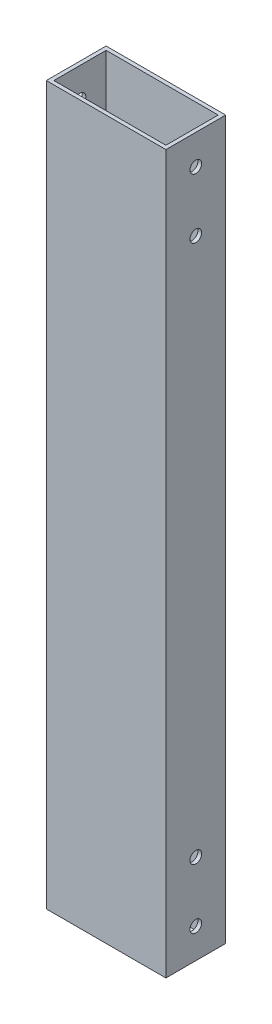
ISO-10303-21;
HEADER;
FILE_DESCRIPTION(('STEP AP214'),'2;1');
FILE_NAME('part.step','',(''),(''),'','','');
FILE_SCHEMA(('AUTOMOTIVE_DESIGN { 1 0 10303 214 1 1 1 1 }'));
ENDSEC;
DATA;
#1=APPLICATION_CONTEXT('core data for automotive mechanical design processes');
#2=APPLICATION_PROTOCOL_DEFINITION('international standard','automotive_design',2000,#1);
#3=PRODUCT_CONTEXT('',#1,'mechanical');
#4=PRODUCT('Part','Part','',(#3));
#5=PRODUCT_RELATED_PRODUCT_CATEGORY('part','',(#4));
#6=PRODUCT_DEFINITION_FORMATION('','',#4);
#7=PRODUCT_DEFINITION_CONTEXT('part definition',#1,'design');
#8=PRODUCT_DEFINITION('design','',#6,#7);
#9=PRODUCT_DEFINITION_SHAPE('','',#8);
#10=(LENGTH_UNIT() NAMED_UNIT(*) SI_UNIT(.MILLI.,.METRE.));
#11=(NAMED_UNIT(*) PLANE_ANGLE_UNIT() SI_UNIT($,.RADIAN.));
#12=(NAMED_UNIT(*) SI_UNIT($,.STERADIAN.) SOLID_ANGLE_UNIT());
#13=UNCERTAINTY_MEASURE_WITH_UNIT(LENGTH_MEASURE(1.E-05),#10,'distance_accuracy_value','');
#14=(GEOMETRIC_REPRESENTATION_CONTEXT(3) GLOBAL_UNCERTAINTY_ASSIGNED_CONTEXT((#13)) GLOBAL_UNIT_ASSIGNED_CONTEXT((#10,
#11,#12)) REPRESENTATION_CONTEXT('',''));
#15=CARTESIAN_POINT('',(0.,0.,0.));
#16=DIRECTION('',(0.,0.,1.));
#17=DIRECTION('',(1.,0.,0.));
#18=AXIS2_PLACEMENT_3D('',#15,#16,#17);
#19=CARTESIAN_POINT('',(0.,12.7,-12.7));
#20=DIRECTION('',(1.,0.,0.));
#21=DIRECTION('',(0.,0.,-1.));
#22=AXIS2_PLACEMENT_3D('',#19,#20,#21);
#23=CYLINDRICAL_SURFACE('',#22,2.4892);
#24=CARTESIAN_POINT('',(1.5875,12.7,-12.7));
#25=DIRECTION('',(-1.,0.,0.));
#26=DIRECTION('',(0.,0.,-1.));
#27=AXIS2_PLACEMENT_3D('',#24,#25,#26);
#28=CIRCLE('',#27,2.4892);
#29=CARTESIAN_POINT('',(1.5875,12.7,-15.1892));
#30=VERTEX_POINT('',#29);
#31=EDGE_CURVE('E165',#30,#30,#28,.T.);
#32=ORIENTED_EDGE('',*,*,#31,.F.);
#33=EDGE_LOOP('',(#32));
#34=FACE_BOUND('',#33,.T.);
#35=CARTESIAN_POINT('',(0.,12.7,-12.7));
#36=DIRECTION('',(-1.,0.,0.));
#37=DIRECTION('',(0.,0.,-1.));
#38=AXIS2_PLACEMENT_3D('',#35,#36,#37);
#39=CIRCLE('',#38,2.4892);
#40=CARTESIAN_POINT('',(0.,12.7,-15.1892));
#41=VERTEX_POINT('',#40);
#42=EDGE_CURVE('E190',#41,#41,#39,.T.);
#43=ORIENTED_EDGE('',*,*,#42,.T.);
#44=EDGE_LOOP('',(#43));
#45=FACE_BOUND('',#44,.T.);
#46=ADVANCED_FACE('F15',(#34,#45),#23,.F.);
#47=CARTESIAN_POINT('',(0.,38.1,-12.7));
#48=DIRECTION('',(1.,0.,0.));
#49=DIRECTION('',(0.,0.,-1.));
#50=AXIS2_PLACEMENT_3D('',#47,#48,#49);
#51=CYLINDRICAL_SURFACE('',#50,2.4892);
#52=CARTESIAN_POINT('',(1.5875,38.1,-12.7));
#53=DIRECTION('',(-1.,0.,0.));
#54=DIRECTION('',(0.,0.,-1.));
#55=AXIS2_PLACEMENT_3D('',#52,#53,#54);
#56=CIRCLE('',#55,2.4892);
#57=CARTESIAN_POINT('',(1.5875,38.1,-15.1892));
#58=VERTEX_POINT('',#57);
#59=EDGE_CURVE('E156',#58,#58,#56,.T.);
#60=ORIENTED_EDGE('',*,*,#59,.F.);
#61=EDGE_LOOP('',(#60));
#62=FACE_BOUND('',#61,.T.);
#63=CARTESIAN_POINT('',(0.,38.1,-12.7));
#64=DIRECTION('',(-1.,0.,0.));
#65=DIRECTION('',(0.,0.,-1.));
#66=AXIS2_PLACEMENT_3D('',#63,#64,#65);
#67=CIRCLE('',#66,2.4892);
#68=CARTESIAN_POINT('',(0.,38.1,-15.1892));
#69=VERTEX_POINT('',#68);
#70=EDGE_CURVE('E186',#69,#69,#67,.T.);
#71=ORIENTED_EDGE('',*,*,#70,.T.);
#72=EDGE_LOOP('',(#71));
#73=FACE_BOUND('',#72,.T.);
#74=ADVANCED_FACE('F281',(#62,#73),#51,.F.);
#75=CARTESIAN_POINT('',(0.,12.7,-12.7));
#76=DIRECTION('',(1.,0.,0.));
#77=DIRECTION('',(0.,0.,-1.));
#78=AXIS2_PLACEMENT_3D('',#75,#76,#77);
#79=CYLINDRICAL_SURFACE('',#78,2.4892);
#80=CARTESIAN_POINT('',(49.2125,12.7,-12.7));
#81=DIRECTION('',(1.,0.,0.));
#82=DIRECTION('',(0.,0.,1.));
#83=AXIS2_PLACEMENT_3D('',#80,#81,#82);
#84=CIRCLE('',#83,2.4892);
#85=CARTESIAN_POINT('',(49.2125,12.7,-10.2108));
#86=VERTEX_POINT('',#85);
#87=EDGE_CURVE('E264',#86,#86,#84,.T.);
#88=ORIENTED_EDGE('',*,*,#87,.F.);
#89=EDGE_LOOP('',(#88));
#90=FACE_BOUND('',#89,.T.);
#91=CARTESIAN_POINT('',(50.8,12.7,-12.7));
#92=DIRECTION('',(-1.,0.,0.));
#93=DIRECTION('',(0.,0.,-1.));
#94=AXIS2_PLACEMENT_3D('',#91,#92,#93);
#95=CIRCLE('',#94,2.4892);
#96=CARTESIAN_POINT('',(50.8,12.7,-15.1892));
#97=VERTEX_POINT('',#96);
#98=EDGE_CURVE('E207',#97,#97,#95,.T.);
#99=ORIENTED_EDGE('',*,*,#98,.F.);
#100=EDGE_LOOP('',(#99));
#101=FACE_BOUND('',#100,.T.);
#102=ADVANCED_FACE('F277',(#90,#101),#79,.F.);
#103=CARTESIAN_POINT('',(0.,38.1,-12.7));
#104=DIRECTION('',(1.,0.,0.));
#105=DIRECTION('',(0.,0.,-1.));
#106=AXIS2_PLACEMENT_3D('',#103,#104,#105);
#107=CYLINDRICAL_SURFACE('',#106,2.4892);
#108=CARTESIAN_POINT('',(49.2125,38.1,-12.7));
#109=DIRECTION('',(1.,0.,0.));
#110=DIRECTION('',(0.,0.,1.));
#111=AXIS2_PLACEMENT_3D('',#108,#109,#110);
#112=CIRCLE('',#111,2.4892);
#113=CARTESIAN_POINT('',(49.2125,38.1,-10.2108));
#114=VERTEX_POINT('',#113);
#115=EDGE_CURVE('E267',#114,#114,#112,.T.);
#116=ORIENTED_EDGE('',*,*,#115,.F.);
#117=EDGE_LOOP('',(#116));
#118=FACE_BOUND('',#117,.T.);
#119=CARTESIAN_POINT('',(50.8,38.1,-12.7));
#120=DIRECTION('',(-1.,0.,0.));
#121=DIRECTION('',(0.,0.,-1.));
#122=AXIS2_PLACEMENT_3D('',#119,#120,#121);
#123=CIRCLE('',#122,2.4892);
#124=CARTESIAN_POINT('',(50.8,38.1,-15.1892));
#125=VERTEX_POINT('',#124);
#126=EDGE_CURVE('E203',#125,#125,#123,.T.);
#127=ORIENTED_EDGE('',*,*,#126,.F.);
#128=EDGE_LOOP('',(#127));
#129=FACE_BOUND('',#128,.T.);
#130=ADVANCED_FACE('F280',(#118,#129),#107,.F.);
#131=CARTESIAN_POINT('',(0.,292.1,-12.7));
#132=DIRECTION('',(1.,0.,0.));
#133=DIRECTION('',(0.,0.,-1.));
#134=AXIS2_PLACEMENT_3D('',#131,#132,#133);
#135=CYLINDRICAL_SURFACE('',#134,2.4892);
#136=CARTESIAN_POINT('',(1.5875,292.1,-12.7));
#137=DIRECTION('',(1.,0.,0.));
#138=DIRECTION('',(0.,0.,-1.));
#139=AXIS2_PLACEMENT_3D('',#136,#137,#138);
#140=CIRCLE('',#139,2.4892);
#141=CARTESIAN_POINT('',(1.5875,292.1,-15.1892));
#142=VERTEX_POINT('',#141);
#143=EDGE_CURVE('E150',#142,#142,#140,.T.);
#144=ORIENTED_EDGE('',*,*,#143,.T.);
#145=EDGE_LOOP('',(#144));
#146=FACE_BOUND('',#145,.T.);
#147=CARTESIAN_POINT('',(0.,292.1,-12.7));
#148=DIRECTION('',(1.,0.,0.));
#149=DIRECTION('',(0.,0.,-1.));
#150=AXIS2_PLACEMENT_3D('',#147,#148,#149);
#151=CIRCLE('',#150,2.4892);
#152=CARTESIAN_POINT('',(0.,292.1,-15.1892));
#153=VERTEX_POINT('',#152);
#154=EDGE_CURVE('E189',#153,#153,#151,.T.);
#155=ORIENTED_EDGE('',*,*,#154,.F.);
#156=EDGE_LOOP('',(#155));
#157=FACE_BOUND('',#156,.T.);
#158=ADVANCED_FACE('F151',(#146,#157),#135,.F.);
#159=CARTESIAN_POINT('',(0.,266.7,-12.7));
#160=DIRECTION('',(1.,0.,0.));
#161=DIRECTION('',(0.,0.,-1.));
#162=AXIS2_PLACEMENT_3D('',#159,#160,#161);
#163=CYLINDRICAL_SURFACE('',#162,2.4892);
#164=CARTESIAN_POINT('',(1.5875,266.7,-12.7));
#165=DIRECTION('',(1.,0.,0.));
#166=DIRECTION('',(0.,0.,-1.));
#167=AXIS2_PLACEMENT_3D('',#164,#165,#166);
#168=CIRCLE('',#167,2.4892);
#169=CARTESIAN_POINT('',(1.5875,266.7,-15.1892));
#170=VERTEX_POINT('',#169);
#171=EDGE_CURVE('E155',#170,#170,#168,.T.);
#172=ORIENTED_EDGE('',*,*,#171,.T.);
#173=EDGE_LOOP('',(#172));
#174=FACE_BOUND('',#173,.T.);
#175=CARTESIAN_POINT('',(0.,266.7,-12.7));
#176=DIRECTION('',(1.,0.,0.));
#177=DIRECTION('',(0.,0.,-1.));
#178=AXIS2_PLACEMENT_3D('',#175,#176,#177);
#179=CIRCLE('',#178,2.4892);
#180=CARTESIAN_POINT('',(0.,266.7,-15.1892));
#181=VERTEX_POINT('',#180);
#182=EDGE_CURVE('E19',#181,#181,#179,.T.);
#183=ORIENTED_EDGE('',*,*,#182,.F.);
#184=EDGE_LOOP('',(#183));
#185=FACE_BOUND('',#184,.T.);
#186=ADVANCED_FACE('F378',(#174,#185),#163,.F.);
#187=CARTESIAN_POINT('',(0.,292.1,-12.7));
#188=DIRECTION('',(1.,0.,0.));
#189=DIRECTION('',(0.,0.,-1.));
#190=AXIS2_PLACEMENT_3D('',#187,#188,#189);
#191=CYLINDRICAL_SURFACE('',#190,2.4892);
#192=CARTESIAN_POINT('',(49.2125,292.1,-12.7));
#193=DIRECTION('',(-1.,0.,0.));
#194=DIRECTION('',(0.,0.,1.));
#195=AXIS2_PLACEMENT_3D('',#192,#193,#194);
#196=CIRCLE('',#195,2.4892);
#197=CARTESIAN_POINT('',(49.2125,292.1,-10.2108));
#198=VERTEX_POINT('',#197);
#199=EDGE_CURVE('E26',#198,#198,#196,.T.);
#200=ORIENTED_EDGE('',*,*,#199,.T.);
#201=EDGE_LOOP('',(#200));
#202=FACE_BOUND('',#201,.T.);
#203=CARTESIAN_POINT('',(50.8,292.1,-12.7));
#204=DIRECTION('',(1.,0.,0.));
#205=DIRECTION('',(0.,0.,-1.));
#206=AXIS2_PLACEMENT_3D('',#203,#204,#205);
#207=CIRCLE('',#206,2.4892);
#208=CARTESIAN_POINT('',(50.8,292.1,-15.1892));
#209=VERTEX_POINT('',#208);
#210=EDGE_CURVE('E206',#209,#209,#207,.T.);
#211=ORIENTED_EDGE('',*,*,#210,.T.);
#212=EDGE_LOOP('',(#211));
#213=FACE_BOUND('',#212,.T.);
#214=ADVANCED_FACE('F380',(#202,#213),#191,.F.);
#215=CARTESIAN_POINT('',(0.,266.7,-12.7));
#216=DIRECTION('',(1.,0.,0.));
#217=DIRECTION('',(0.,0.,-1.));
#218=AXIS2_PLACEMENT_3D('',#215,#216,#217);
#219=CYLINDRICAL_SURFACE('',#218,2.4892);
#220=CARTESIAN_POINT('',(49.2125,266.7,-12.7));
#221=DIRECTION('',(-1.,0.,0.));
#222=DIRECTION('',(0.,0.,1.));
#223=AXIS2_PLACEMENT_3D('',#220,#221,#222);
#224=CIRCLE('',#223,2.4892);
#225=CARTESIAN_POINT('',(49.2125,266.7,-10.2108));
#226=VERTEX_POINT('',#225);
#227=EDGE_CURVE('E10',#226,#226,#224,.T.);
#228=ORIENTED_EDGE('',*,*,#227,.T.);
#229=EDGE_LOOP('',(#228));
#230=FACE_BOUND('',#229,.T.);
#231=CARTESIAN_POINT('',(50.8,266.7,-12.7));
#232=DIRECTION('',(1.,0.,0.));
#233=DIRECTION('',(0.,0.,-1.));
#234=AXIS2_PLACEMENT_3D('',#231,#232,#233);
#235=CIRCLE('',#234,2.4892);
#236=CARTESIAN_POINT('',(50.8,266.7,-15.1892));
#237=VERTEX_POINT('',#236);
#238=EDGE_CURVE('E232',#237,#237,#235,.T.);
#239=ORIENTED_EDGE('',*,*,#238,.T.);
#240=EDGE_LOOP('',(#239));
#241=FACE_BOUND('',#240,.T.);
#242=ADVANCED_FACE('F386',(#230,#241),#219,.F.);
#243=CARTESIAN_POINT('',(1.5875,304.8,-23.8125));
#244=DIRECTION('',(0.,0.,1.));
#245=DIRECTION('',(1.,0.,0.));
#246=AXIS2_PLACEMENT_3D('',#243,#244,#245);
#247=PLANE('',#246);
#248=DIRECTION('',(-1.,0.,0.));
#249=VECTOR('',#248,1.);
#250=CARTESIAN_POINT('',(1.5875,0.,-23.8125));
#251=LINE('',#250,#249);
#252=CARTESIAN_POINT('',(49.2125,0.,-23.8125));
#253=VERTEX_POINT('',#252);
#254=CARTESIAN_POINT('',(1.5875,0.,-23.8125));
#255=VERTEX_POINT('',#254);
#256=EDGE_CURVE('E185',#253,#255,#251,.T.);
#257=ORIENTED_EDGE('',*,*,#256,.F.);
#258=DIRECTION('',(0.,-1.,0.));
#259=VECTOR('',#258,1.);
#260=CARTESIAN_POINT('',(49.2125,304.8,-23.8125));
#261=LINE('',#260,#259);
#262=CARTESIAN_POINT('',(49.2125,304.8,-23.8125));
#263=VERTEX_POINT('',#262);
#264=EDGE_CURVE('E260',#263,#253,#261,.T.);
#265=ORIENTED_EDGE('',*,*,#264,.F.);
#266=DIRECTION('',(-1.,0.,0.));
#267=VECTOR('',#266,1.);
#268=CARTESIAN_POINT('',(1.5875,304.8,-23.8125));
#269=LINE('',#268,#267);
#270=CARTESIAN_POINT('',(1.5875,304.8,-23.8125));
#271=VERTEX_POINT('',#270);
#272=EDGE_CURVE('E227',#263,#271,#269,.T.);
#273=ORIENTED_EDGE('',*,*,#272,.T.);
#274=DIRECTION('',(0.,-1.,0.));
#275=VECTOR('',#274,1.);
#276=CARTESIAN_POINT('',(1.5875,304.8,-23.8125));
#277=LINE('',#276,#275);
#278=EDGE_CURVE('E235',#271,#255,#277,.T.);
#279=ORIENTED_EDGE('',*,*,#278,.T.);
#280=EDGE_LOOP('',(#257,#265,#273,#279));
#281=FACE_BOUND('',#280,.T.);
#282=ADVANCED_FACE('F326',(#281),#247,.T.);
#283=CARTESIAN_POINT('',(49.2125,304.8,-1.5875));
#284=DIRECTION('',(-1.,0.,0.));
#285=DIRECTION('',(0.,0.,1.));
#286=AXIS2_PLACEMENT_3D('',#283,#284,#285);
#287=PLANE('',#286);
#288=ORIENTED_EDGE('',*,*,#227,.F.);
#289=EDGE_LOOP('',(#288));
#290=FACE_BOUND('',#289,.T.);
#291=ORIENTED_EDGE('',*,*,#199,.F.);
#292=EDGE_LOOP('',(#291));
#293=FACE_BOUND('',#292,.T.);
#294=ORIENTED_EDGE('',*,*,#115,.T.);
#295=EDGE_LOOP('',(#294));
#296=FACE_BOUND('',#295,.T.);
#297=ORIENTED_EDGE('',*,*,#87,.T.);
#298=EDGE_LOOP('',(#297));
#299=FACE_BOUND('',#298,.T.);
#300=DIRECTION('',(0.,0.,-1.));
#301=VECTOR('',#300,1.);
#302=CARTESIAN_POINT('',(49.2125,0.,-1.5875));
#303=LINE('',#302,#301);
#304=CARTESIAN_POINT('',(49.2125,0.,-1.5875));
#305=VERTEX_POINT('',#304);
#306=EDGE_CURVE('E196',#305,#253,#303,.T.);
#307=ORIENTED_EDGE('',*,*,#306,.F.);
#308=DIRECTION('',(0.,-1.,0.));
#309=VECTOR('',#308,1.);
#310=CARTESIAN_POINT('',(49.2125,304.8,-1.5875));
#311=LINE('',#310,#309);
#312=CARTESIAN_POINT('',(49.2125,304.8,-1.5875));
#313=VERTEX_POINT('',#312);
#314=EDGE_CURVE('E163',#313,#305,#311,.T.);
#315=ORIENTED_EDGE('',*,*,#314,.F.);
#316=DIRECTION('',(0.,0.,-1.));
#317=VECTOR('',#316,1.);
#318=CARTESIAN_POINT('',(49.2125,304.8,-1.5875));
#319=LINE('',#318,#317);
#320=EDGE_CURVE('E179',#313,#263,#319,.T.);
#321=ORIENTED_EDGE('',*,*,#320,.T.);
#322=ORIENTED_EDGE('',*,*,#264,.T.);
#323=EDGE_LOOP('',(#307,#315,#321,#322));
#324=FACE_BOUND('',#323,.T.);
#325=ADVANCED_FACE('F274',(#290,#293,#296,#299,#324),#287,.T.);
#326=CARTESIAN_POINT('',(1.5875,304.8,-1.5875));
#327=DIRECTION('',(0.,0.,-1.));
#328=DIRECTION('',(0.,-1.,0.));
#329=AXIS2_PLACEMENT_3D('',#326,#327,#328);
#330=PLANE('',#329);
#331=DIRECTION('',(1.,0.,0.));
#332=VECTOR('',#331,1.);
#333=CARTESIAN_POINT('',(1.5875,0.,-1.5875));
#334=LINE('',#333,#332);
#335=CARTESIAN_POINT('',(1.5875,0.,-1.5875));
#336=VERTEX_POINT('',#335);
#337=EDGE_CURVE('E184',#336,#305,#334,.T.);
#338=ORIENTED_EDGE('',*,*,#337,.F.);
#339=DIRECTION('',(0.,-1.,0.));
#340=VECTOR('',#339,1.);
#341=CARTESIAN_POINT('',(1.5875,304.8,-1.5875));
#342=LINE('',#341,#340);
#343=CARTESIAN_POINT('',(1.5875,304.8,-1.5875));
#344=VERTEX_POINT('',#343);
#345=EDGE_CURVE('E173',#344,#336,#342,.T.);
#346=ORIENTED_EDGE('',*,*,#345,.F.);
#347=DIRECTION('',(1.,0.,0.));
#348=VECTOR('',#347,1.);
#349=CARTESIAN_POINT('',(1.5875,304.8,-1.5875));
#350=LINE('',#349,#348);
#351=EDGE_CURVE('E174',#344,#313,#350,.T.);
#352=ORIENTED_EDGE('',*,*,#351,.T.);
#353=ORIENTED_EDGE('',*,*,#314,.T.);
#354=EDGE_LOOP('',(#338,#346,#352,#353));
#355=FACE_BOUND('',#354,.T.);
#356=ADVANCED_FACE('F317',(#355),#330,.T.);
#357=CARTESIAN_POINT('',(1.5875,304.8,-1.5875));
#358=DIRECTION('',(1.,0.,0.));
#359=DIRECTION('',(0.,1.,0.));
#360=AXIS2_PLACEMENT_3D('',#357,#358,#359);
#361=PLANE('',#360);
#362=ORIENTED_EDGE('',*,*,#171,.F.);
#363=EDGE_LOOP('',(#362));
#364=FACE_BOUND('',#363,.T.);
#365=ORIENTED_EDGE('',*,*,#143,.F.);
#366=EDGE_LOOP('',(#365));
#367=FACE_BOUND('',#366,.T.);
#368=ORIENTED_EDGE('',*,*,#59,.T.);
#369=EDGE_LOOP('',(#368));
#370=FACE_BOUND('',#369,.T.);
#371=ORIENTED_EDGE('',*,*,#31,.T.);
#372=EDGE_LOOP('',(#371));
#373=FACE_BOUND('',#372,.T.);
#374=DIRECTION('',(0.,0.,1.));
#375=VECTOR('',#374,1.);
#376=CARTESIAN_POINT('',(1.5875,0.,-1.5875));
#377=LINE('',#376,#375);
#378=EDGE_CURVE('E180',#255,#336,#377,.T.);
#379=ORIENTED_EDGE('',*,*,#378,.F.);
#380=ORIENTED_EDGE('',*,*,#278,.F.);
#381=DIRECTION('',(0.,0.,1.));
#382=VECTOR('',#381,1.);
#383=CARTESIAN_POINT('',(1.5875,304.8,-1.5875));
#384=LINE('',#383,#382);
#385=EDGE_CURVE('E216',#271,#344,#384,.T.);
#386=ORIENTED_EDGE('',*,*,#385,.T.);
#387=ORIENTED_EDGE('',*,*,#345,.T.);
#388=EDGE_LOOP('',(#379,#380,#386,#387));
#389=FACE_BOUND('',#388,.T.);
#390=ADVANCED_FACE('F323',(#364,#367,#370,#373,#389),#361,.T.);
#391=CARTESIAN_POINT('',(0.,304.8,-25.4));
#392=DIRECTION('',(0.,0.,1.));
#393=DIRECTION('',(1.,0.,0.));
#394=AXIS2_PLACEMENT_3D('',#391,#392,#393);
#395=PLANE('',#394);
#396=DIRECTION('',(-1.,0.,0.));
#397=VECTOR('',#396,1.);
#398=CARTESIAN_POINT('',(0.,0.,-25.4));
#399=LINE('',#398,#397);
#400=CARTESIAN_POINT('',(50.8,0.,-25.4));
#401=VERTEX_POINT('',#400);
#402=CARTESIAN_POINT('',(0.,0.,-25.4));
#403=VERTEX_POINT('',#402);
#404=EDGE_CURVE('E242',#401,#403,#399,.T.);
#405=ORIENTED_EDGE('',*,*,#404,.T.);
#406=DIRECTION('',(0.,-1.,0.));
#407=VECTOR('',#406,1.);
#408=CARTESIAN_POINT('',(0.,304.8,-25.4));
#409=LINE('',#408,#407);
#410=CARTESIAN_POINT('',(0.,304.8,-25.4));
#411=VERTEX_POINT('',#410);
#412=EDGE_CURVE('E195',#411,#403,#409,.T.);
#413=ORIENTED_EDGE('',*,*,#412,.F.);
#414=DIRECTION('',(-1.,0.,0.));
#415=VECTOR('',#414,1.);
#416=CARTESIAN_POINT('',(0.,304.8,-25.4));
#417=LINE('',#416,#415);
#418=CARTESIAN_POINT('',(50.8,304.8,-25.4));
#419=VERTEX_POINT('',#418);
#420=EDGE_CURVE('E212',#419,#411,#417,.T.);
#421=ORIENTED_EDGE('',*,*,#420,.F.);
#422=DIRECTION('',(0.,-1.,0.));
#423=VECTOR('',#422,1.);
#424=CARTESIAN_POINT('',(50.8,304.8,-25.4));
#425=LINE('',#424,#423);
#426=EDGE_CURVE('E228',#419,#401,#425,.T.);
#427=ORIENTED_EDGE('',*,*,#426,.T.);
#428=EDGE_LOOP('',(#405,#413,#421,#427));
#429=FACE_BOUND('',#428,.T.);
#430=ADVANCED_FACE('F347',(#429),#395,.F.);
#431=CARTESIAN_POINT('',(50.8,304.8,0.));
#432=DIRECTION('',(-1.,0.,0.));
#433=DIRECTION('',(0.,0.,1.));
#434=AXIS2_PLACEMENT_3D('',#431,#432,#433);
#435=PLANE('',#434);
#436=ORIENTED_EDGE('',*,*,#238,.F.);
#437=EDGE_LOOP('',(#436));
#438=FACE_BOUND('',#437,.T.);
#439=ORIENTED_EDGE('',*,*,#210,.F.);
#440=EDGE_LOOP('',(#439));
#441=FACE_BOUND('',#440,.T.);
#442=ORIENTED_EDGE('',*,*,#126,.T.);
#443=EDGE_LOOP('',(#442));
#444=FACE_BOUND('',#443,.T.);
#445=ORIENTED_EDGE('',*,*,#98,.T.);
#446=EDGE_LOOP('',(#445));
#447=FACE_BOUND('',#446,.T.);
#448=DIRECTION('',(0.,0.,-1.));
#449=VECTOR('',#448,1.);
#450=CARTESIAN_POINT('',(50.8,0.,0.));
#451=LINE('',#450,#449);
#452=CARTESIAN_POINT('',(50.8,0.,0.));
#453=VERTEX_POINT('',#452);
#454=EDGE_CURVE('E239',#453,#401,#451,.T.);
#455=ORIENTED_EDGE('',*,*,#454,.T.);
#456=ORIENTED_EDGE('',*,*,#426,.F.);
#457=DIRECTION('',(0.,0.,-1.));
#458=VECTOR('',#457,1.);
#459=CARTESIAN_POINT('',(50.8,304.8,0.));
#460=LINE('',#459,#458);
#461=CARTESIAN_POINT('',(50.8,304.8,0.));
#462=VERTEX_POINT('',#461);
#463=EDGE_CURVE('E201',#462,#419,#460,.T.);
#464=ORIENTED_EDGE('',*,*,#463,.F.);
#465=DIRECTION('',(0.,-1.,0.));
#466=VECTOR('',#465,1.);
#467=CARTESIAN_POINT('',(50.8,304.8,0.));
#468=LINE('',#467,#466);
#469=EDGE_CURVE('E231',#462,#453,#468,.T.);
#470=ORIENTED_EDGE('',*,*,#469,.T.);
#471=EDGE_LOOP('',(#455,#456,#464,#470));
#472=FACE_BOUND('',#471,.T.);
#473=ADVANCED_FACE('F344',(#438,#441,#444,#447,#472),#435,.F.);
#474=CARTESIAN_POINT('',(0.,304.8,0.));
#475=DIRECTION('',(0.,0.,-1.));
#476=DIRECTION('',(0.,-1.,0.));
#477=AXIS2_PLACEMENT_3D('',#474,#475,#476);
#478=PLANE('',#477);
#479=DIRECTION('',(1.,0.,0.));
#480=VECTOR('',#479,1.);
#481=CARTESIAN_POINT('',(0.,0.,0.));
#482=LINE('',#481,#480);
#483=CARTESIAN_POINT('',(0.,0.,0.));
#484=VERTEX_POINT('',#483);
#485=EDGE_CURVE('E223',#484,#453,#482,.T.);
#486=ORIENTED_EDGE('',*,*,#485,.T.);
#487=ORIENTED_EDGE('',*,*,#469,.F.);
#488=DIRECTION('',(1.,0.,0.));
#489=VECTOR('',#488,1.);
#490=CARTESIAN_POINT('',(0.,304.8,0.));
#491=LINE('',#490,#489);
#492=CARTESIAN_POINT('',(0.,304.8,0.));
#493=VERTEX_POINT('',#492);
#494=EDGE_CURVE('E197',#493,#462,#491,.T.);
#495=ORIENTED_EDGE('',*,*,#494,.F.);
#496=DIRECTION('',(0.,-1.,0.));
#497=VECTOR('',#496,1.);
#498=CARTESIAN_POINT('',(0.,304.8,0.));
#499=LINE('',#498,#497);
#500=EDGE_CURVE('E191',#493,#484,#499,.T.);
#501=ORIENTED_EDGE('',*,*,#500,.T.);
#502=EDGE_LOOP('',(#486,#487,#495,#501));
#503=FACE_BOUND('',#502,.T.);
#504=ADVANCED_FACE('F17',(#503),#478,.F.);
#505=CARTESIAN_POINT('',(0.,304.8,0.));
#506=DIRECTION('',(1.,0.,0.));
#507=DIRECTION('',(0.,1.,0.));
#508=AXIS2_PLACEMENT_3D('',#505,#506,#507);
#509=PLANE('',#508);
#510=ORIENTED_EDGE('',*,*,#182,.T.);
#511=EDGE_LOOP('',(#510));
#512=FACE_BOUND('',#511,.T.);
#513=ORIENTED_EDGE('',*,*,#154,.T.);
#514=EDGE_LOOP('',(#513));
#515=FACE_BOUND('',#514,.T.);
#516=ORIENTED_EDGE('',*,*,#70,.F.);
#517=EDGE_LOOP('',(#516));
#518=FACE_BOUND('',#517,.T.);
#519=ORIENTED_EDGE('',*,*,#42,.F.);
#520=EDGE_LOOP('',(#519));
#521=FACE_BOUND('',#520,.T.);
#522=DIRECTION('',(0.,0.,1.));
#523=VECTOR('',#522,1.);
#524=CARTESIAN_POINT('',(0.,0.,0.));
#525=LINE('',#524,#523);
#526=EDGE_CURVE('E178',#403,#484,#525,.T.);
#527=ORIENTED_EDGE('',*,*,#526,.T.);
#528=ORIENTED_EDGE('',*,*,#500,.F.);
#529=DIRECTION('',(0.,0.,1.));
#530=VECTOR('',#529,1.);
#531=CARTESIAN_POINT('',(0.,304.8,0.));
#532=LINE('',#531,#530);
#533=EDGE_CURVE('E202',#411,#493,#532,.T.);
#534=ORIENTED_EDGE('',*,*,#533,.F.);
#535=ORIENTED_EDGE('',*,*,#412,.T.);
#536=EDGE_LOOP('',(#527,#528,#534,#535));
#537=FACE_BOUND('',#536,.T.);
#538=ADVANCED_FACE('F336',(#512,#515,#518,#521,#537),#509,.F.);
#539=CARTESIAN_POINT('',(0.,0.,0.));
#540=DIRECTION('',(0.,-1.,0.));
#541=DIRECTION('',(0.,0.,-1.));
#542=AXIS2_PLACEMENT_3D('',#539,#540,#541);
#543=PLANE('',#542);
#544=ORIENTED_EDGE('',*,*,#256,.T.);
#545=ORIENTED_EDGE('',*,*,#378,.T.);
#546=ORIENTED_EDGE('',*,*,#337,.T.);
#547=ORIENTED_EDGE('',*,*,#306,.T.);
#548=EDGE_LOOP('',(#544,#545,#546,#547));
#549=FACE_BOUND('',#548,.T.);
#550=ORIENTED_EDGE('',*,*,#526,.F.);
#551=ORIENTED_EDGE('',*,*,#404,.F.);
#552=ORIENTED_EDGE('',*,*,#454,.F.);
#553=ORIENTED_EDGE('',*,*,#485,.F.);
#554=EDGE_LOOP('',(#550,#551,#552,#553));
#555=FACE_BOUND('',#554,.T.);
#556=ADVANCED_FACE('F321',(#549,#555),#543,.T.);
#557=CARTESIAN_POINT('',(0.,304.8,0.));
#558=DIRECTION('',(0.,-1.,0.));
#559=DIRECTION('',(0.,0.,-1.));
#560=AXIS2_PLACEMENT_3D('',#557,#558,#559);
#561=PLANE('',#560);
#562=ORIENTED_EDGE('',*,*,#385,.F.);
#563=ORIENTED_EDGE('',*,*,#272,.F.);
#564=ORIENTED_EDGE('',*,*,#320,.F.);
#565=ORIENTED_EDGE('',*,*,#351,.F.);
#566=EDGE_LOOP('',(#562,#563,#564,#565));
#567=FACE_BOUND('',#566,.T.);
#568=ORIENTED_EDGE('',*,*,#533,.T.);
#569=ORIENTED_EDGE('',*,*,#494,.T.);
#570=ORIENTED_EDGE('',*,*,#463,.T.);
#571=ORIENTED_EDGE('',*,*,#420,.T.);
#572=EDGE_LOOP('',(#568,#569,#570,#571));
#573=FACE_BOUND('',#572,.T.);
#574=ADVANCED_FACE('F328',(#567,#573),#561,.F.);
#575=CLOSED_SHELL('',(#46,#74,#102,#130,#158,#186,#214,#242,#282,#325,#356,#390,#430,#473,#504,
#538,#556,#574));
#576=MANIFOLD_SOLID_BREP('B1',#575);
#577=ADVANCED_BREP_SHAPE_REPRESENTATION('',(#18,#576),#14);
#578=SHAPE_DEFINITION_REPRESENTATION(#9,#577);
ENDSEC;
END-ISO-10303-21;
